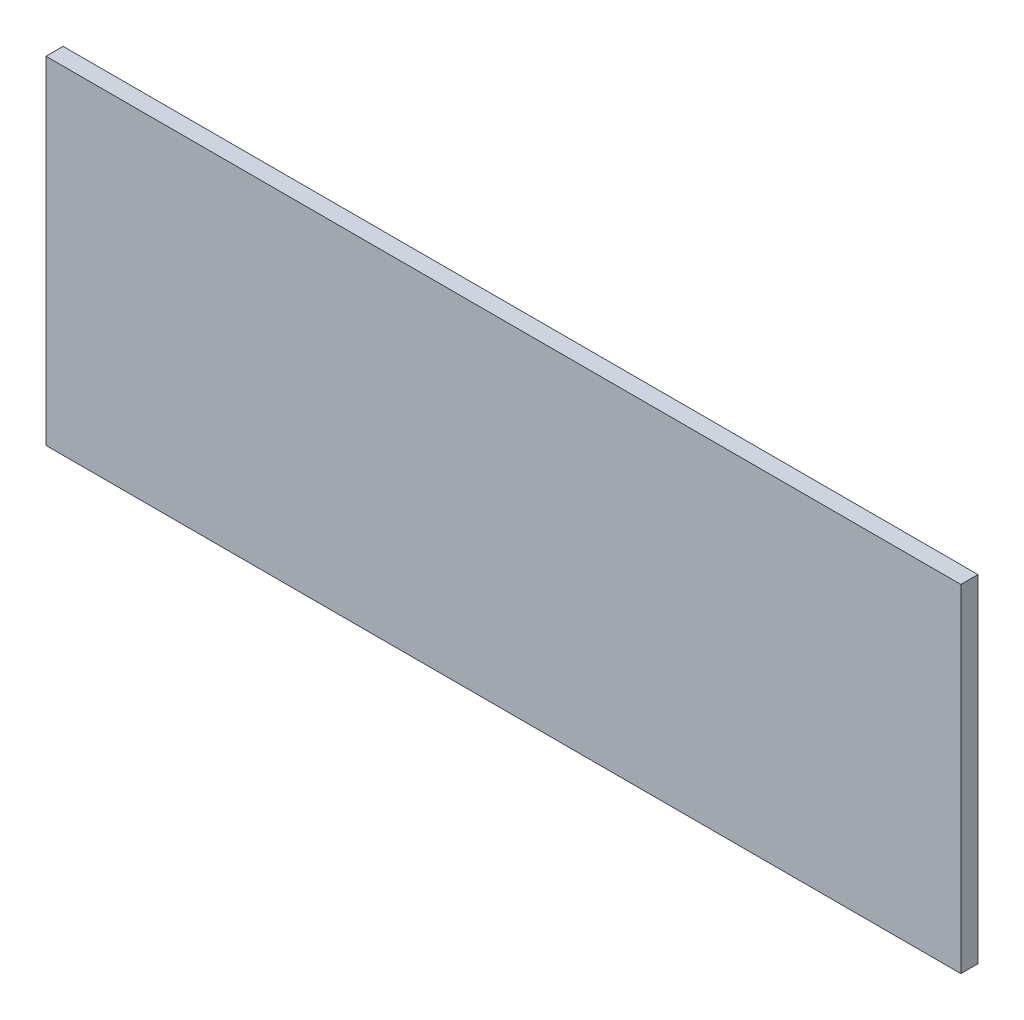
ISO-10303-21;
HEADER;
FILE_DESCRIPTION(('STEP AP214'),'2;1');
FILE_NAME('part.step','',(''),(''),'','','');
FILE_SCHEMA(('AUTOMOTIVE_DESIGN { 1 0 10303 214 1 1 1 1 }'));
ENDSEC;
DATA;
#1=APPLICATION_CONTEXT('core data for automotive mechanical design processes');
#2=APPLICATION_PROTOCOL_DEFINITION('international standard','automotive_design',2000,#1);
#3=PRODUCT_CONTEXT('',#1,'mechanical');
#4=PRODUCT('Part','Part','',(#3));
#5=PRODUCT_RELATED_PRODUCT_CATEGORY('part','',(#4));
#6=PRODUCT_DEFINITION_FORMATION('','',#4);
#7=PRODUCT_DEFINITION_CONTEXT('part definition',#1,'design');
#8=PRODUCT_DEFINITION('design','',#6,#7);
#9=PRODUCT_DEFINITION_SHAPE('','',#8);
#10=(LENGTH_UNIT() NAMED_UNIT(*) SI_UNIT(.MILLI.,.METRE.));
#11=(NAMED_UNIT(*) PLANE_ANGLE_UNIT() SI_UNIT($,.RADIAN.));
#12=(NAMED_UNIT(*) SI_UNIT($,.STERADIAN.) SOLID_ANGLE_UNIT());
#13=UNCERTAINTY_MEASURE_WITH_UNIT(LENGTH_MEASURE(1.E-05),#10,'distance_accuracy_value','');
#14=(GEOMETRIC_REPRESENTATION_CONTEXT(3) GLOBAL_UNCERTAINTY_ASSIGNED_CONTEXT((#13)) GLOBAL_UNIT_ASSIGNED_CONTEXT((#10,
#11,#12)) REPRESENTATION_CONTEXT('',''));
#15=CARTESIAN_POINT('',(0.,0.,0.));
#16=DIRECTION('',(0.,0.,1.));
#17=DIRECTION('',(1.,0.,0.));
#18=AXIS2_PLACEMENT_3D('',#15,#16,#17);
#19=CARTESIAN_POINT('',(81.8669967651367,63.8370018005371,0.));
#20=DIRECTION('',(0.,1.,0.));
#21=DIRECTION('',(1.,0.,0.));
#22=AXIS2_PLACEMENT_3D('',#19,#20,#21);
#23=PLANE('',#22);
#24=DIRECTION('',(1.,0.,0.));
#25=VECTOR('',#24,1.);
#26=CARTESIAN_POINT('',(81.8669967651367,63.8370018005371,0.03556));
#27=LINE('',#26,#25);
#28=CARTESIAN_POINT('',(81.8669967651367,63.8370018005371,0.03556));
#29=VERTEX_POINT('',#28);
#30=CARTESIAN_POINT('',(83.7669982910156,63.8370018005371,0.03556));
#31=VERTEX_POINT('',#30);
#32=EDGE_CURVE('E11',#29,#31,#27,.T.);
#33=ORIENTED_EDGE('',*,*,#32,.F.);
#34=DIRECTION('',(0.,0.,1.));
#35=VECTOR('',#34,1.);
#36=CARTESIAN_POINT('',(81.8669967651367,63.8370018005371,0.));
#37=LINE('',#36,#35);
#38=CARTESIAN_POINT('',(81.8669967651367,63.8370018005371,0.));
#39=VERTEX_POINT('',#38);
#40=EDGE_CURVE('E24',#39,#29,#37,.T.);
#41=ORIENTED_EDGE('',*,*,#40,.F.);
#42=DIRECTION('',(1.,0.,0.));
#43=VECTOR('',#42,1.);
#44=CARTESIAN_POINT('',(81.8669967651367,63.8370018005371,0.));
#45=LINE('',#44,#43);
#46=CARTESIAN_POINT('',(83.7669982910156,63.8370018005371,0.));
#47=VERTEX_POINT('',#46);
#48=EDGE_CURVE('E75',#39,#47,#45,.T.);
#49=ORIENTED_EDGE('',*,*,#48,.T.);
#50=DIRECTION('',(0.,0.,1.));
#51=VECTOR('',#50,1.);
#52=CARTESIAN_POINT('',(83.7669982910156,63.8370018005371,0.));
#53=LINE('',#52,#51);
#54=EDGE_CURVE('E37',#47,#31,#53,.T.);
#55=ORIENTED_EDGE('',*,*,#54,.T.);
#56=EDGE_LOOP('',(#33,#41,#49,#55));
#57=FACE_BOUND('',#56,.T.);
#58=ADVANCED_FACE('F17',(#57),#23,.F.);
#59=CARTESIAN_POINT('',(83.7669982910156,63.8370018005371,0.));
#60=DIRECTION('',(-1.,0.,0.));
#61=DIRECTION('',(0.,1.,0.));
#62=AXIS2_PLACEMENT_3D('',#59,#60,#61);
#63=PLANE('',#62);
#64=DIRECTION('',(0.,1.,0.));
#65=VECTOR('',#64,1.);
#66=CARTESIAN_POINT('',(83.7669982910156,63.8370018005371,0.03556));
#67=LINE('',#66,#65);
#68=CARTESIAN_POINT('',(83.7669982910156,64.5370025634766,0.03556));
#69=VERTEX_POINT('',#68);
#70=EDGE_CURVE('E83',#31,#69,#67,.T.);
#71=ORIENTED_EDGE('',*,*,#70,.F.);
#72=ORIENTED_EDGE('',*,*,#54,.F.);
#73=DIRECTION('',(0.,1.,0.));
#74=VECTOR('',#73,1.);
#75=CARTESIAN_POINT('',(83.7669982910156,63.8370018005371,0.));
#76=LINE('',#75,#74);
#77=CARTESIAN_POINT('',(83.7669982910156,64.5370025634766,0.));
#78=VERTEX_POINT('',#77);
#79=EDGE_CURVE('E81',#47,#78,#76,.T.);
#80=ORIENTED_EDGE('',*,*,#79,.T.);
#81=DIRECTION('',(0.,0.,1.));
#82=VECTOR('',#81,1.);
#83=CARTESIAN_POINT('',(83.7669982910156,64.5370025634766,0.));
#84=LINE('',#83,#82);
#85=EDGE_CURVE('E67',#78,#69,#84,.T.);
#86=ORIENTED_EDGE('',*,*,#85,.T.);
#87=EDGE_LOOP('',(#71,#72,#80,#86));
#88=FACE_BOUND('',#87,.T.);
#89=ADVANCED_FACE('F89',(#88),#63,.F.);
#90=CARTESIAN_POINT('',(83.7669982910156,64.5370025634766,0.));
#91=DIRECTION('',(0.,-1.,0.));
#92=DIRECTION('',(-1.,0.,0.));
#93=AXIS2_PLACEMENT_3D('',#90,#91,#92);
#94=PLANE('',#93);
#95=DIRECTION('',(-1.,0.,0.));
#96=VECTOR('',#95,1.);
#97=CARTESIAN_POINT('',(83.7669982910156,64.5370025634766,0.03556));
#98=LINE('',#97,#96);
#99=CARTESIAN_POINT('',(81.8669967651367,64.5370025634766,0.03556));
#100=VERTEX_POINT('',#99);
#101=EDGE_CURVE('E71',#69,#100,#98,.T.);
#102=ORIENTED_EDGE('',*,*,#101,.F.);
#103=ORIENTED_EDGE('',*,*,#85,.F.);
#104=DIRECTION('',(-1.,0.,0.));
#105=VECTOR('',#104,1.);
#106=CARTESIAN_POINT('',(83.7669982910156,64.5370025634766,0.));
#107=LINE('',#106,#105);
#108=CARTESIAN_POINT('',(81.8669967651367,64.5370025634766,0.));
#109=VERTEX_POINT('',#108);
#110=EDGE_CURVE('E63',#78,#109,#107,.T.);
#111=ORIENTED_EDGE('',*,*,#110,.T.);
#112=DIRECTION('',(0.,0.,1.));
#113=VECTOR('',#112,1.);
#114=CARTESIAN_POINT('',(81.8669967651367,64.5370025634766,0.));
#115=LINE('',#114,#113);
#116=EDGE_CURVE('E53',#109,#100,#115,.T.);
#117=ORIENTED_EDGE('',*,*,#116,.T.);
#118=EDGE_LOOP('',(#102,#103,#111,#117));
#119=FACE_BOUND('',#118,.T.);
#120=ADVANCED_FACE('F66',(#119),#94,.F.);
#121=CARTESIAN_POINT('',(81.8669967651367,64.5370025634766,0.));
#122=DIRECTION('',(1.,0.,0.));
#123=DIRECTION('',(0.,-1.,0.));
#124=AXIS2_PLACEMENT_3D('',#121,#122,#123);
#125=PLANE('',#124);
#126=DIRECTION('',(0.,-1.,0.));
#127=VECTOR('',#126,1.);
#128=CARTESIAN_POINT('',(81.8669967651367,64.5370025634766,0.03556));
#129=LINE('',#128,#127);
#130=EDGE_CURVE('E59',#100,#29,#129,.T.);
#131=ORIENTED_EDGE('',*,*,#130,.F.);
#132=ORIENTED_EDGE('',*,*,#116,.F.);
#133=DIRECTION('',(0.,-1.,0.));
#134=VECTOR('',#133,1.);
#135=CARTESIAN_POINT('',(81.8669967651367,64.5370025634766,0.));
#136=LINE('',#135,#134);
#137=EDGE_CURVE('E57',#109,#39,#136,.T.);
#138=ORIENTED_EDGE('',*,*,#137,.T.);
#139=ORIENTED_EDGE('',*,*,#40,.T.);
#140=EDGE_LOOP('',(#131,#132,#138,#139));
#141=FACE_BOUND('',#140,.T.);
#142=ADVANCED_FACE('F55',(#141),#125,.F.);
#143=CARTESIAN_POINT('',(81.8669967651367,63.8370018005371,0.));
#144=DIRECTION('',(0.,0.,-1.));
#145=DIRECTION('',(-1.,0.,0.));
#146=AXIS2_PLACEMENT_3D('',#143,#144,#145);
#147=PLANE('',#146);
#148=ORIENTED_EDGE('',*,*,#137,.F.);
#149=ORIENTED_EDGE('',*,*,#110,.F.);
#150=ORIENTED_EDGE('',*,*,#79,.F.);
#151=ORIENTED_EDGE('',*,*,#48,.F.);
#152=EDGE_LOOP('',(#148,#149,#150,#151));
#153=FACE_BOUND('',#152,.T.);
#154=ADVANCED_FACE('F74',(#153),#147,.T.);
#155=CARTESIAN_POINT('',(81.8669967651367,63.8370018005371,0.03556));
#156=DIRECTION('',(0.,0.,-1.));
#157=DIRECTION('',(-1.,0.,0.));
#158=AXIS2_PLACEMENT_3D('',#155,#156,#157);
#159=PLANE('',#158);
#160=ORIENTED_EDGE('',*,*,#32,.T.);
#161=ORIENTED_EDGE('',*,*,#70,.T.);
#162=ORIENTED_EDGE('',*,*,#101,.T.);
#163=ORIENTED_EDGE('',*,*,#130,.T.);
#164=EDGE_LOOP('',(#160,#161,#162,#163));
#165=FACE_BOUND('',#164,.T.);
#166=ADVANCED_FACE('F91',(#165),#159,.F.);
#167=CLOSED_SHELL('',(#58,#89,#120,#142,#154,#166));
#168=MANIFOLD_SOLID_BREP('B1',#167);
#169=ADVANCED_BREP_SHAPE_REPRESENTATION('',(#18,#168),#14);
#170=SHAPE_DEFINITION_REPRESENTATION(#9,#169);
ENDSEC;
END-ISO-10303-21;
